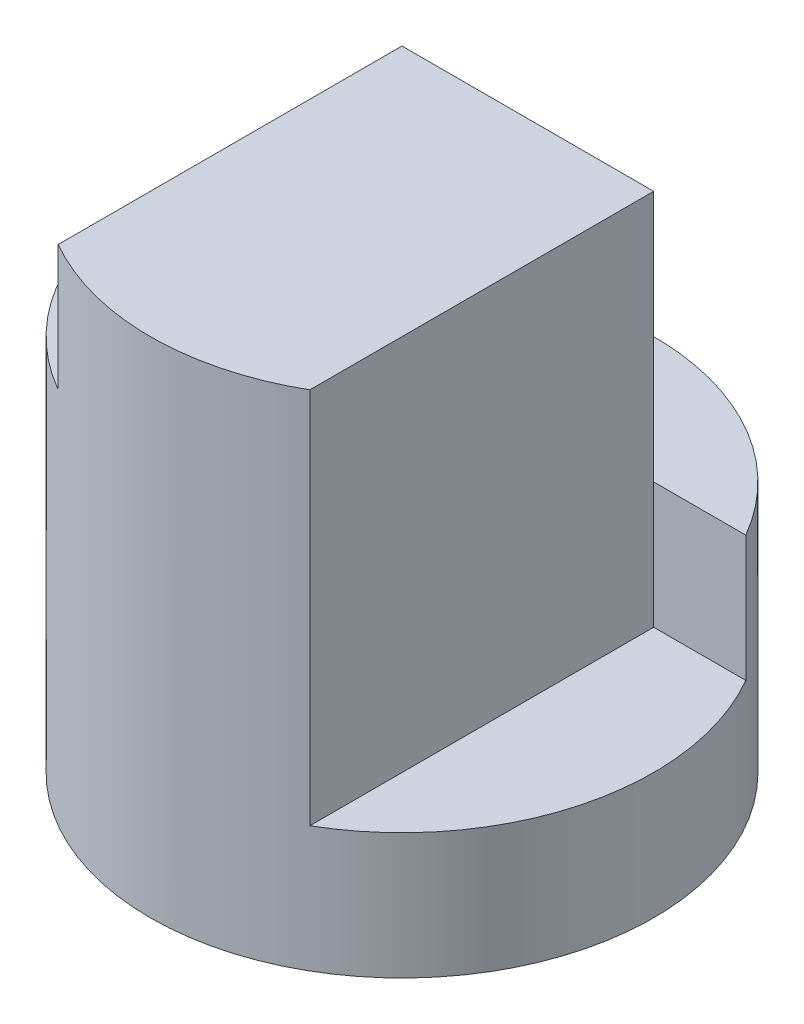
ISO-10303-21;
HEADER;
FILE_DESCRIPTION(('STEP AP214'),'2;1');
FILE_NAME('part.step','',(''),(''),'','','');
FILE_SCHEMA(('AUTOMOTIVE_DESIGN { 1 0 10303 214 1 1 1 1 }'));
ENDSEC;
DATA;
#1=APPLICATION_CONTEXT('core data for automotive mechanical design processes');
#2=APPLICATION_PROTOCOL_DEFINITION('international standard','automotive_design',2000,#1);
#3=PRODUCT_CONTEXT('',#1,'mechanical');
#4=PRODUCT('Part','Part','',(#3));
#5=PRODUCT_RELATED_PRODUCT_CATEGORY('part','',(#4));
#6=PRODUCT_DEFINITION_FORMATION('','',#4);
#7=PRODUCT_DEFINITION_CONTEXT('part definition',#1,'design');
#8=PRODUCT_DEFINITION('design','',#6,#7);
#9=PRODUCT_DEFINITION_SHAPE('','',#8);
#10=(LENGTH_UNIT() NAMED_UNIT(*) SI_UNIT(.MILLI.,.METRE.));
#11=(NAMED_UNIT(*) PLANE_ANGLE_UNIT() SI_UNIT($,.RADIAN.));
#12=(NAMED_UNIT(*) SI_UNIT($,.STERADIAN.) SOLID_ANGLE_UNIT());
#13=UNCERTAINTY_MEASURE_WITH_UNIT(LENGTH_MEASURE(1.E-05),#10,'distance_accuracy_value','');
#14=(GEOMETRIC_REPRESENTATION_CONTEXT(3) GLOBAL_UNCERTAINTY_ASSIGNED_CONTEXT((#13)) GLOBAL_UNIT_ASSIGNED_CONTEXT((#10,
#11,#12)) REPRESENTATION_CONTEXT('',''));
#15=CARTESIAN_POINT('',(0.,0.,0.));
#16=DIRECTION('',(0.,0.,1.));
#17=DIRECTION('',(1.,0.,0.));
#18=AXIS2_PLACEMENT_3D('',#15,#16,#17);
#19=CARTESIAN_POINT('',(0.,4.,0.));
#20=DIRECTION('',(0.,-1.,0.));
#21=DIRECTION('',(0.,0.,-1.));
#22=AXIS2_PLACEMENT_3D('',#19,#20,#21);
#23=CYLINDRICAL_SURFACE('',#22,2.);
#24=CARTESIAN_POINT('',(0.,0.,0.));
#25=DIRECTION('',(0.,1.,0.));
#26=DIRECTION('',(0.,0.,1.));
#27=AXIS2_PLACEMENT_3D('',#24,#25,#26);
#28=CIRCLE('',#27,2.);
#29=CARTESIAN_POINT('',(0.,0.,2.));
#30=VERTEX_POINT('',#29);
#31=EDGE_CURVE('E126',#30,#30,#28,.T.);
#32=ORIENTED_EDGE('',*,*,#31,.T.);
#33=EDGE_LOOP('',(#32));
#34=FACE_BOUND('',#33,.T.);
#35=CARTESIAN_POINT('',(0.,3.,0.));
#36=DIRECTION('',(0.,1.,0.));
#37=DIRECTION('',(0.,0.,1.));
#38=AXIS2_PLACEMENT_3D('',#35,#36,#37);
#39=CIRCLE('',#38,2.);
#40=CARTESIAN_POINT('',(-1.73205080756888,3.,-1.));
#41=VERTEX_POINT('',#40);
#42=CARTESIAN_POINT('',(-1.,3.,1.73205080756888));
#43=VERTEX_POINT('',#42);
#44=EDGE_CURVE('E101',#41,#43,#39,.T.);
#45=ORIENTED_EDGE('',*,*,#44,.F.);
#46=DIRECTION('',(0.,1.,0.));
#47=VECTOR('',#46,1.);
#48=CARTESIAN_POINT('',(-1.73205080756888,2.,-1.));
#49=LINE('',#48,#47);
#50=CARTESIAN_POINT('',(-1.73205080756888,2.,-1.));
#51=VERTEX_POINT('',#50);
#52=EDGE_CURVE('E94',#51,#41,#49,.T.);
#53=ORIENTED_EDGE('',*,*,#52,.F.);
#54=CARTESIAN_POINT('',(0.,2.,0.));
#55=DIRECTION('',(0.,1.,0.));
#56=DIRECTION('',(0.,0.,-1.));
#57=AXIS2_PLACEMENT_3D('',#54,#55,#56);
#58=CIRCLE('',#57,2.);
#59=CARTESIAN_POINT('',(1.73205080756888,2.,-1.));
#60=VERTEX_POINT('',#59);
#61=EDGE_CURVE('E85',#60,#51,#58,.T.);
#62=ORIENTED_EDGE('',*,*,#61,.F.);
#63=DIRECTION('',(0.,-1.,0.));
#64=VECTOR('',#63,1.);
#65=CARTESIAN_POINT('',(1.73205080756888,4.,-1.));
#66=LINE('',#65,#64);
#67=CARTESIAN_POINT('',(1.73205080756888,1.,-1.));
#68=VERTEX_POINT('',#67);
#69=EDGE_CURVE('E122',#68,#60,#66,.F.);
#70=ORIENTED_EDGE('',*,*,#69,.F.);
#71=CARTESIAN_POINT('',(0.,1.,0.));
#72=DIRECTION('',(0.,1.,0.));
#73=DIRECTION('',(0.,0.,1.));
#74=AXIS2_PLACEMENT_3D('',#71,#72,#73);
#75=CIRCLE('',#74,2.);
#76=CARTESIAN_POINT('',(1.,1.,1.73205080756888));
#77=VERTEX_POINT('',#76);
#78=EDGE_CURVE('E40',#77,#68,#75,.T.);
#79=ORIENTED_EDGE('',*,*,#78,.F.);
#80=DIRECTION('',(0.,-1.,0.));
#81=VECTOR('',#80,1.);
#82=CARTESIAN_POINT('',(1.,4.,1.73205080756888));
#83=LINE('',#82,#81);
#84=CARTESIAN_POINT('',(1.,4.,1.73205080756888));
#85=VERTEX_POINT('',#84);
#86=EDGE_CURVE('E124',#85,#77,#83,.T.);
#87=ORIENTED_EDGE('',*,*,#86,.F.);
#88=CARTESIAN_POINT('',(0.,4.,0.));
#89=DIRECTION('',(0.,1.,0.));
#90=DIRECTION('',(0.,0.,1.));
#91=AXIS2_PLACEMENT_3D('',#88,#89,#90);
#92=CIRCLE('',#91,2.);
#93=CARTESIAN_POINT('',(-1.,4.,1.73205080756888));
#94=VERTEX_POINT('',#93);
#95=EDGE_CURVE('E127',#94,#85,#92,.T.);
#96=ORIENTED_EDGE('',*,*,#95,.F.);
#97=DIRECTION('',(0.,-1.,0.));
#98=VECTOR('',#97,1.);
#99=CARTESIAN_POINT('',(-1.,4.,1.73205080756888));
#100=LINE('',#99,#98);
#101=EDGE_CURVE('E115',#43,#94,#100,.F.);
#102=ORIENTED_EDGE('',*,*,#101,.F.);
#103=EDGE_LOOP('',(#45,#53,#62,#70,#79,#87,#96,#102));
#104=FACE_BOUND('',#103,.T.);
#105=ADVANCED_FACE('F33',(#34,#104),#23,.T.);
#106=CARTESIAN_POINT('',(0.,4.,0.));
#107=DIRECTION('',(0.,1.,0.));
#108=DIRECTION('',(0.,0.,1.));
#109=AXIS2_PLACEMENT_3D('',#106,#107,#108);
#110=PLANE('',#109);
#111=DIRECTION('',(1.,0.,0.));
#112=VECTOR('',#111,1.);
#113=CARTESIAN_POINT('',(-1.73205080756888,4.,-1.));
#114=LINE('',#113,#112);
#115=CARTESIAN_POINT('',(-1.,4.,-1.));
#116=VERTEX_POINT('',#115);
#117=CARTESIAN_POINT('',(1.,4.,-1.));
#118=VERTEX_POINT('',#117);
#119=EDGE_CURVE('E90',#116,#118,#114,.T.);
#120=ORIENTED_EDGE('',*,*,#119,.F.);
#121=DIRECTION('',(0.,0.,1.));
#122=VECTOR('',#121,1.);
#123=CARTESIAN_POINT('',(-1.,4.,0.));
#124=LINE('',#123,#122);
#125=EDGE_CURVE('E130',#116,#94,#124,.T.);
#126=ORIENTED_EDGE('',*,*,#125,.T.);
#127=ORIENTED_EDGE('',*,*,#95,.T.);
#128=DIRECTION('',(0.,0.,-1.));
#129=VECTOR('',#128,1.);
#130=CARTESIAN_POINT('',(1.,4.,0.));
#131=LINE('',#130,#129);
#132=EDGE_CURVE('E135',#85,#118,#131,.T.);
#133=ORIENTED_EDGE('',*,*,#132,.T.);
#134=EDGE_LOOP('',(#120,#126,#127,#133));
#135=FACE_BOUND('',#134,.T.);
#136=ADVANCED_FACE('F150',(#135),#110,.T.);
#137=CARTESIAN_POINT('',(0.,0.,0.));
#138=DIRECTION('',(0.,1.,0.));
#139=DIRECTION('',(0.,0.,1.));
#140=AXIS2_PLACEMENT_3D('',#137,#138,#139);
#141=PLANE('',#140);
#142=ORIENTED_EDGE('',*,*,#31,.F.);
#143=EDGE_LOOP('',(#142));
#144=FACE_BOUND('',#143,.T.);
#145=ADVANCED_FACE('F159',(#144),#141,.F.);
#146=CARTESIAN_POINT('',(-2.,3.,3.));
#147=DIRECTION('',(0.,1.,0.));
#148=DIRECTION('',(0.,0.,1.));
#149=AXIS2_PLACEMENT_3D('',#146,#147,#148);
#150=PLANE('',#149);
#151=ORIENTED_EDGE('',*,*,#44,.T.);
#152=DIRECTION('',(0.,0.,-1.));
#153=VECTOR('',#152,1.);
#154=CARTESIAN_POINT('',(-1.,3.,3.));
#155=LINE('',#154,#153);
#156=CARTESIAN_POINT('',(-1.,3.,-1.));
#157=VERTEX_POINT('',#156);
#158=EDGE_CURVE('E118',#43,#157,#155,.T.);
#159=ORIENTED_EDGE('',*,*,#158,.T.);
#160=DIRECTION('',(1.,0.,0.));
#161=VECTOR('',#160,1.);
#162=CARTESIAN_POINT('',(-2.,3.,-1.));
#163=LINE('',#162,#161);
#164=EDGE_CURVE('E102',#41,#157,#163,.T.);
#165=ORIENTED_EDGE('',*,*,#164,.F.);
#166=EDGE_LOOP('',(#151,#159,#165));
#167=FACE_BOUND('',#166,.T.);
#168=ADVANCED_FACE('F157',(#167),#150,.T.);
#169=CARTESIAN_POINT('',(-1.,4.,3.));
#170=DIRECTION('',(-1.,0.,0.));
#171=DIRECTION('',(0.,-1.,0.));
#172=AXIS2_PLACEMENT_3D('',#169,#170,#171);
#173=PLANE('',#172);
#174=ORIENTED_EDGE('',*,*,#101,.T.);
#175=ORIENTED_EDGE('',*,*,#125,.F.);
#176=DIRECTION('',(0.,1.,0.));
#177=VECTOR('',#176,1.);
#178=CARTESIAN_POINT('',(-1.,4.,-1.));
#179=LINE('',#178,#177);
#180=EDGE_CURVE('E104',#157,#116,#179,.T.);
#181=ORIENTED_EDGE('',*,*,#180,.F.);
#182=ORIENTED_EDGE('',*,*,#158,.F.);
#183=EDGE_LOOP('',(#174,#175,#181,#182));
#184=FACE_BOUND('',#183,.T.);
#185=ADVANCED_FACE('F154',(#184),#173,.T.);
#186=CARTESIAN_POINT('',(1.,1.,3.));
#187=DIRECTION('',(0.,1.,0.));
#188=DIRECTION('',(0.,0.,1.));
#189=AXIS2_PLACEMENT_3D('',#186,#187,#188);
#190=PLANE('',#189);
#191=DIRECTION('',(0.,0.,-1.));
#192=VECTOR('',#191,1.);
#193=CARTESIAN_POINT('',(1.,1.,3.));
#194=LINE('',#193,#192);
#195=CARTESIAN_POINT('',(1.,1.,-1.));
#196=VERTEX_POINT('',#195);
#197=EDGE_CURVE('E113',#77,#196,#194,.T.);
#198=ORIENTED_EDGE('',*,*,#197,.F.);
#199=ORIENTED_EDGE('',*,*,#78,.T.);
#200=DIRECTION('',(1.,0.,0.));
#201=VECTOR('',#200,1.);
#202=CARTESIAN_POINT('',(1.,1.,-1.));
#203=LINE('',#202,#201);
#204=EDGE_CURVE('E109',#196,#68,#203,.T.);
#205=ORIENTED_EDGE('',*,*,#204,.F.);
#206=EDGE_LOOP('',(#198,#199,#205));
#207=FACE_BOUND('',#206,.T.);
#208=ADVANCED_FACE('F141',(#207),#190,.T.);
#209=CARTESIAN_POINT('',(1.,4.,3.));
#210=DIRECTION('',(1.,0.,0.));
#211=DIRECTION('',(0.,0.,-1.));
#212=AXIS2_PLACEMENT_3D('',#209,#210,#211);
#213=PLANE('',#212);
#214=ORIENTED_EDGE('',*,*,#86,.T.);
#215=ORIENTED_EDGE('',*,*,#197,.T.);
#216=DIRECTION('',(0.,-1.,0.));
#217=VECTOR('',#216,1.);
#218=CARTESIAN_POINT('',(1.,4.,-1.));
#219=LINE('',#218,#217);
#220=CARTESIAN_POINT('',(1.,2.,-1.));
#221=VERTEX_POINT('',#220);
#222=EDGE_CURVE('E110',#221,#196,#219,.T.);
#223=ORIENTED_EDGE('',*,*,#222,.F.);
#224=EDGE_CURVE('E97',#118,#221,#219,.T.);
#225=ORIENTED_EDGE('',*,*,#224,.F.);
#226=ORIENTED_EDGE('',*,*,#132,.F.);
#227=EDGE_LOOP('',(#214,#215,#223,#225,#226));
#228=FACE_BOUND('',#227,.T.);
#229=ADVANCED_FACE('F146',(#228),#213,.T.);
#230=CARTESIAN_POINT('',(0.,0.,-1.));
#231=DIRECTION('',(0.,0.,1.));
#232=DIRECTION('',(1.,0.,0.));
#233=AXIS2_PLACEMENT_3D('',#230,#231,#232);
#234=PLANE('',#233);
#235=DIRECTION('',(1.,0.,0.));
#236=VECTOR('',#235,1.);
#237=CARTESIAN_POINT('',(0.,2.,-1.));
#238=LINE('',#237,#236);
#239=EDGE_CURVE('E11',#221,#60,#238,.T.);
#240=ORIENTED_EDGE('',*,*,#239,.F.);
#241=ORIENTED_EDGE('',*,*,#222,.T.);
#242=ORIENTED_EDGE('',*,*,#204,.T.);
#243=ORIENTED_EDGE('',*,*,#69,.T.);
#244=EDGE_LOOP('',(#240,#241,#242,#243));
#245=FACE_BOUND('',#244,.T.);
#246=ADVANCED_FACE('F143',(#245),#234,.T.);
#247=CARTESIAN_POINT('',(-1.73205080756888,2.,-1.));
#248=DIRECTION('',(0.,0.,1.));
#249=DIRECTION('',(1.,0.,0.));
#250=AXIS2_PLACEMENT_3D('',#247,#248,#249);
#251=PLANE('',#250);
#252=ORIENTED_EDGE('',*,*,#164,.T.);
#253=ORIENTED_EDGE('',*,*,#180,.T.);
#254=ORIENTED_EDGE('',*,*,#119,.T.);
#255=ORIENTED_EDGE('',*,*,#224,.T.);
#256=DIRECTION('',(1.,0.,0.));
#257=VECTOR('',#256,1.);
#258=CARTESIAN_POINT('',(-1.73205080756888,2.,-1.));
#259=LINE('',#258,#257);
#260=EDGE_CURVE('E46',#51,#221,#259,.T.);
#261=ORIENTED_EDGE('',*,*,#260,.F.);
#262=ORIENTED_EDGE('',*,*,#52,.T.);
#263=EDGE_LOOP('',(#252,#253,#254,#255,#261,#262));
#264=FACE_BOUND('',#263,.T.);
#265=ADVANCED_FACE('F93',(#264),#251,.F.);
#266=CARTESIAN_POINT('',(0.,2.,0.));
#267=DIRECTION('',(0.,-1.,0.));
#268=DIRECTION('',(0.,0.,-1.));
#269=AXIS2_PLACEMENT_3D('',#266,#267,#268);
#270=PLANE('',#269);
#271=ORIENTED_EDGE('',*,*,#61,.T.);
#272=ORIENTED_EDGE('',*,*,#260,.T.);
#273=ORIENTED_EDGE('',*,*,#239,.T.);
#274=EDGE_LOOP('',(#271,#272,#273));
#275=FACE_BOUND('',#274,.T.);
#276=ADVANCED_FACE('F86',(#275),#270,.F.);
#277=CLOSED_SHELL('',(#105,#136,#145,#168,#185,#208,#229,#246,#265,#276));
#278=MANIFOLD_SOLID_BREP('B2',#277);
#279=ADVANCED_BREP_SHAPE_REPRESENTATION('',(#18,#278),#14);
#280=SHAPE_DEFINITION_REPRESENTATION(#9,#279);
ENDSEC;
END-ISO-10303-21;
